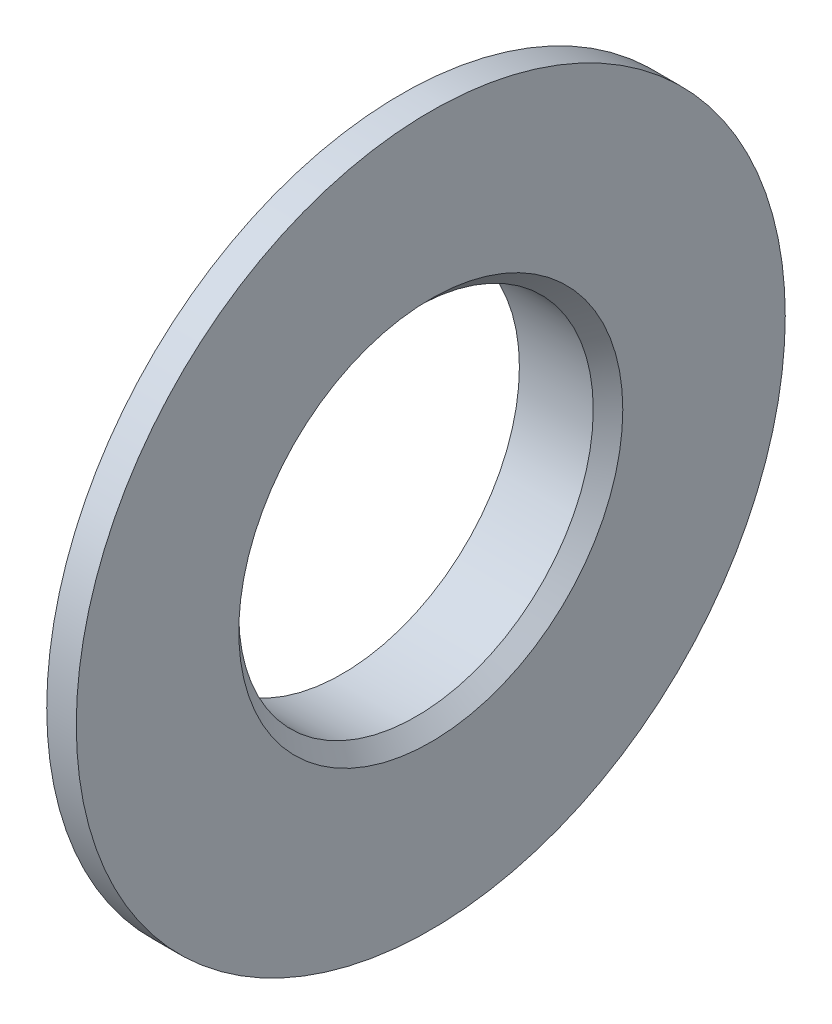
ISO-10303-21;
HEADER;
FILE_DESCRIPTION(('STEP AP214'),'2;1');
FILE_NAME('part.step','',(''),(''),'','','');
FILE_SCHEMA(('AUTOMOTIVE_DESIGN { 1 0 10303 214 1 1 1 1 }'));
ENDSEC;
DATA;
#1=APPLICATION_CONTEXT('core data for automotive mechanical design processes');
#2=APPLICATION_PROTOCOL_DEFINITION('international standard','automotive_design',2000,#1);
#3=PRODUCT_CONTEXT('',#1,'mechanical');
#4=PRODUCT('Part','Part','',(#3));
#5=PRODUCT_RELATED_PRODUCT_CATEGORY('part','',(#4));
#6=PRODUCT_DEFINITION_FORMATION('','',#4);
#7=PRODUCT_DEFINITION_CONTEXT('part definition',#1,'design');
#8=PRODUCT_DEFINITION('design','',#6,#7);
#9=PRODUCT_DEFINITION_SHAPE('','',#8);
#10=(LENGTH_UNIT() NAMED_UNIT(*) SI_UNIT(.MILLI.,.METRE.));
#11=(NAMED_UNIT(*) PLANE_ANGLE_UNIT() SI_UNIT($,.RADIAN.));
#12=(NAMED_UNIT(*) SI_UNIT($,.STERADIAN.) SOLID_ANGLE_UNIT());
#13=UNCERTAINTY_MEASURE_WITH_UNIT(LENGTH_MEASURE(1.E-05),#10,'distance_accuracy_value','');
#14=(GEOMETRIC_REPRESENTATION_CONTEXT(3) GLOBAL_UNCERTAINTY_ASSIGNED_CONTEXT((#13)) GLOBAL_UNIT_ASSIGNED_CONTEXT((#10,
#11,#12)) REPRESENTATION_CONTEXT('',''));
#15=CARTESIAN_POINT('',(0.,0.,0.));
#16=DIRECTION('',(0.,0.,1.));
#17=DIRECTION('',(1.,0.,0.));
#18=AXIS2_PLACEMENT_3D('',#15,#16,#17);
#19=CARTESIAN_POINT('',(0.,12.,0.));
#20=DIRECTION('',(1.,0.,0.));
#21=DIRECTION('',(0.,0.,-1.));
#22=AXIS2_PLACEMENT_3D('',#19,#20,#21);
#23=PLANE('',#22);
#24=CARTESIAN_POINT('',(0.,0.,0.));
#25=DIRECTION('',(1.,0.,0.));
#26=DIRECTION('',(0.,0.,-1.));
#27=AXIS2_PLACEMENT_3D('',#24,#25,#26);
#28=CIRCLE('',#27,6.50000000000001);
#29=CARTESIAN_POINT('',(0.,0.,-6.50000000000001));
#30=VERTEX_POINT('',#29);
#31=EDGE_CURVE('E10',#30,#30,#28,.F.);
#32=ORIENTED_EDGE('',*,*,#31,.T.);
#33=EDGE_LOOP('',(#32));
#34=FACE_BOUND('',#33,.T.);
#35=CARTESIAN_POINT('',(0.,0.,0.));
#36=DIRECTION('',(1.,0.,0.));
#37=DIRECTION('',(0.,0.,-1.));
#38=AXIS2_PLACEMENT_3D('',#35,#36,#37);
#39=CIRCLE('',#38,12.);
#40=CARTESIAN_POINT('',(0.,0.,-12.));
#41=VERTEX_POINT('',#40);
#42=EDGE_CURVE('E65',#41,#41,#39,.T.);
#43=ORIENTED_EDGE('',*,*,#42,.T.);
#44=EDGE_LOOP('',(#43));
#45=FACE_BOUND('',#44,.T.);
#46=ADVANCED_FACE('F38',(#34,#45),#23,.T.);
#47=CARTESIAN_POINT('',(0.,0.,0.));
#48=DIRECTION('',(1.,0.,0.));
#49=DIRECTION('',(0.,0.,-1.));
#50=AXIS2_PLACEMENT_3D('',#47,#48,#49);
#51=CYLINDRICAL_SURFACE('',#50,6.);
#52=CARTESIAN_POINT('',(-0.500000000000003,0.,0.));
#53=DIRECTION('',(1.,0.,0.));
#54=DIRECTION('',(0.,0.,-1.));
#55=AXIS2_PLACEMENT_3D('',#52,#53,#54);
#56=CIRCLE('',#55,6.);
#57=CARTESIAN_POINT('',(-0.500000000000003,0.,-6.));
#58=VERTEX_POINT('',#57);
#59=EDGE_CURVE('E46',#58,#58,#56,.T.);
#60=ORIENTED_EDGE('',*,*,#59,.T.);
#61=EDGE_LOOP('',(#60));
#62=FACE_BOUND('',#61,.T.);
#63=CARTESIAN_POINT('',(-3.,0.,0.));
#64=DIRECTION('',(1.,0.,0.));
#65=DIRECTION('',(0.,0.,-1.));
#66=AXIS2_PLACEMENT_3D('',#63,#64,#65);
#67=CIRCLE('',#66,6.);
#68=CARTESIAN_POINT('',(-3.,0.,-6.));
#69=VERTEX_POINT('',#68);
#70=EDGE_CURVE('E50',#69,#69,#67,.T.);
#71=ORIENTED_EDGE('',*,*,#70,.F.);
#72=EDGE_LOOP('',(#71));
#73=FACE_BOUND('',#72,.T.);
#74=ADVANCED_FACE('F84',(#62,#73),#51,.F.);
#75=CARTESIAN_POINT('',(-3.,6.,0.));
#76=DIRECTION('',(-1.,0.,0.));
#77=DIRECTION('',(0.,0.,1.));
#78=AXIS2_PLACEMENT_3D('',#75,#76,#77);
#79=PLANE('',#78);
#80=ORIENTED_EDGE('',*,*,#70,.T.);
#81=EDGE_LOOP('',(#80));
#82=FACE_BOUND('',#81,.T.);
#83=CARTESIAN_POINT('',(-3.,0.,0.));
#84=DIRECTION('',(1.,0.,0.));
#85=DIRECTION('',(0.,0.,-1.));
#86=AXIS2_PLACEMENT_3D('',#83,#84,#85);
#87=CIRCLE('',#86,7.);
#88=CARTESIAN_POINT('',(-3.,0.,-7.));
#89=VERTEX_POINT('',#88);
#90=EDGE_CURVE('E54',#89,#89,#87,.T.);
#91=ORIENTED_EDGE('',*,*,#90,.F.);
#92=EDGE_LOOP('',(#91));
#93=FACE_BOUND('',#92,.T.);
#94=ADVANCED_FACE('F88',(#82,#93),#79,.T.);
#95=CARTESIAN_POINT('',(0.,0.,0.));
#96=DIRECTION('',(1.,0.,0.));
#97=DIRECTION('',(0.,0.,-1.));
#98=AXIS2_PLACEMENT_3D('',#95,#96,#97);
#99=CYLINDRICAL_SURFACE('',#98,7.);
#100=ORIENTED_EDGE('',*,*,#90,.T.);
#101=EDGE_LOOP('',(#100));
#102=FACE_BOUND('',#101,.T.);
#103=CARTESIAN_POINT('',(-1.,0.,0.));
#104=DIRECTION('',(1.,0.,0.));
#105=DIRECTION('',(0.,0.,-1.));
#106=AXIS2_PLACEMENT_3D('',#103,#104,#105);
#107=CIRCLE('',#106,7.);
#108=CARTESIAN_POINT('',(-1.,0.,-7.));
#109=VERTEX_POINT('',#108);
#110=EDGE_CURVE('E59',#109,#109,#107,.T.);
#111=ORIENTED_EDGE('',*,*,#110,.F.);
#112=EDGE_LOOP('',(#111));
#113=FACE_BOUND('',#112,.T.);
#114=ADVANCED_FACE('F80',(#102,#113),#99,.T.);
#115=CARTESIAN_POINT('',(-1.,7.,0.));
#116=DIRECTION('',(-1.,0.,0.));
#117=DIRECTION('',(0.,0.,1.));
#118=AXIS2_PLACEMENT_3D('',#115,#116,#117);
#119=PLANE('',#118);
#120=ORIENTED_EDGE('',*,*,#110,.T.);
#121=EDGE_LOOP('',(#120));
#122=FACE_BOUND('',#121,.T.);
#123=CARTESIAN_POINT('',(-1.,0.,0.));
#124=DIRECTION('',(1.,0.,0.));
#125=DIRECTION('',(0.,0.,-1.));
#126=AXIS2_PLACEMENT_3D('',#123,#124,#125);
#127=CIRCLE('',#126,12.);
#128=CARTESIAN_POINT('',(-1.,0.,-12.));
#129=VERTEX_POINT('',#128);
#130=EDGE_CURVE('E62',#129,#129,#127,.T.);
#131=ORIENTED_EDGE('',*,*,#130,.F.);
#132=EDGE_LOOP('',(#131));
#133=FACE_BOUND('',#132,.T.);
#134=ADVANCED_FACE('F72',(#122,#133),#119,.T.);
#135=CARTESIAN_POINT('',(0.,0.,0.));
#136=DIRECTION('',(1.,0.,0.));
#137=DIRECTION('',(0.,0.,-1.));
#138=AXIS2_PLACEMENT_3D('',#135,#136,#137);
#139=CYLINDRICAL_SURFACE('',#138,12.);
#140=ORIENTED_EDGE('',*,*,#130,.T.);
#141=EDGE_LOOP('',(#140));
#142=FACE_BOUND('',#141,.T.);
#143=ORIENTED_EDGE('',*,*,#42,.F.);
#144=EDGE_LOOP('',(#143));
#145=FACE_BOUND('',#144,.T.);
#146=ADVANCED_FACE('F70',(#142,#145),#139,.T.);
#147=CARTESIAN_POINT('',(-0.500000000000003,0.,0.));
#148=DIRECTION('',(1.,0.,0.));
#149=DIRECTION('',(0.,0.,-1.));
#150=AXIS2_PLACEMENT_3D('',#147,#148,#149);
#151=CONICAL_SURFACE('',#150,6.,0.785398163397452);
#152=ORIENTED_EDGE('',*,*,#31,.F.);
#153=EDGE_LOOP('',(#152));
#154=FACE_BOUND('',#153,.T.);
#155=ORIENTED_EDGE('',*,*,#59,.F.);
#156=EDGE_LOOP('',(#155));
#157=FACE_BOUND('',#156,.T.);
#158=ADVANCED_FACE('F41',(#154,#157),#151,.F.);
#159=CLOSED_SHELL('',(#46,#74,#94,#114,#134,#146,#158));
#160=MANIFOLD_SOLID_BREP('B2',#159);
#161=ADVANCED_BREP_SHAPE_REPRESENTATION('',(#18,#160),#14);
#162=SHAPE_DEFINITION_REPRESENTATION(#9,#161);
ENDSEC;
END-ISO-10303-21;
